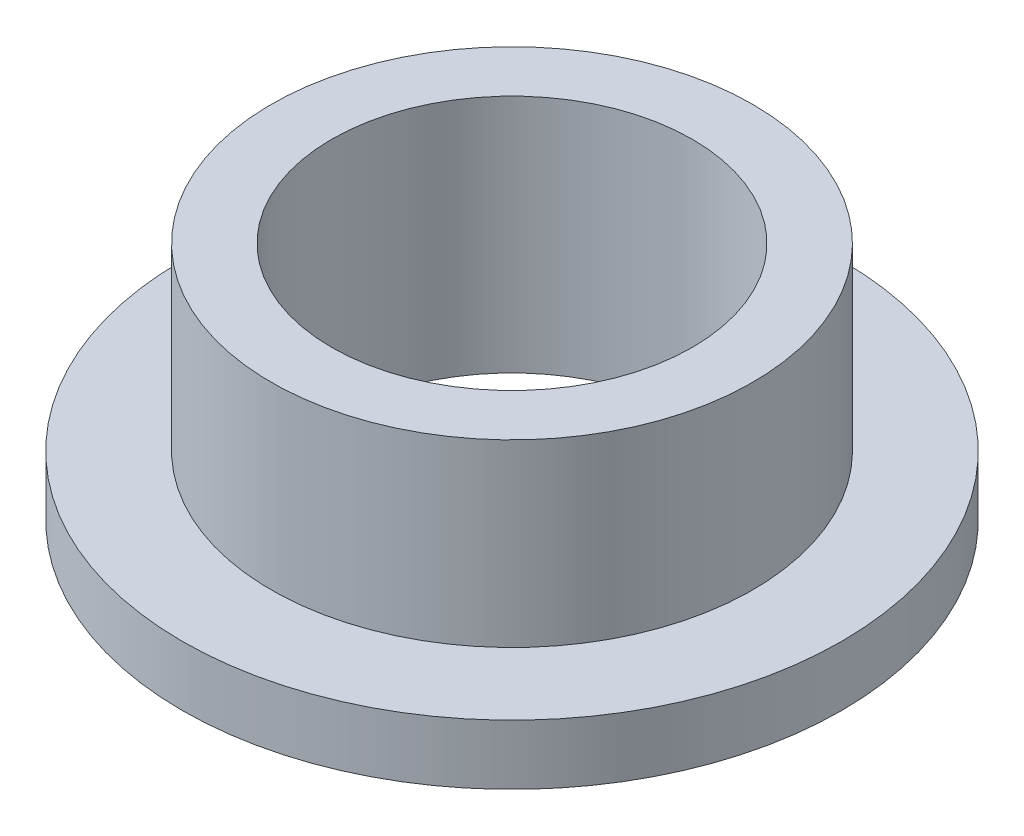
ISO-10303-21;
HEADER;
FILE_DESCRIPTION(('STEP AP214'),'2;1');
FILE_NAME('part.step','',(''),(''),'','','');
FILE_SCHEMA(('AUTOMOTIVE_DESIGN { 1 0 10303 214 1 1 1 1 }'));
ENDSEC;
DATA;
#1=APPLICATION_CONTEXT('core data for automotive mechanical design processes');
#2=APPLICATION_PROTOCOL_DEFINITION('international standard','automotive_design',2000,#1);
#3=PRODUCT_CONTEXT('',#1,'mechanical');
#4=PRODUCT('Part','Part','',(#3));
#5=PRODUCT_RELATED_PRODUCT_CATEGORY('part','',(#4));
#6=PRODUCT_DEFINITION_FORMATION('','',#4);
#7=PRODUCT_DEFINITION_CONTEXT('part definition',#1,'design');
#8=PRODUCT_DEFINITION('design','',#6,#7);
#9=PRODUCT_DEFINITION_SHAPE('','',#8);
#10=(LENGTH_UNIT() NAMED_UNIT(*) SI_UNIT(.MILLI.,.METRE.));
#11=(NAMED_UNIT(*) PLANE_ANGLE_UNIT() SI_UNIT($,.RADIAN.));
#12=(NAMED_UNIT(*) SI_UNIT($,.STERADIAN.) SOLID_ANGLE_UNIT());
#13=UNCERTAINTY_MEASURE_WITH_UNIT(LENGTH_MEASURE(1.E-05),#10,'distance_accuracy_value','');
#14=(GEOMETRIC_REPRESENTATION_CONTEXT(3) GLOBAL_UNCERTAINTY_ASSIGNED_CONTEXT((#13)) GLOBAL_UNIT_ASSIGNED_CONTEXT((#10,
#11,#12)) REPRESENTATION_CONTEXT('',''));
#15=CARTESIAN_POINT('',(0.,0.,0.));
#16=DIRECTION('',(0.,0.,1.));
#17=DIRECTION('',(1.,0.,0.));
#18=AXIS2_PLACEMENT_3D('',#15,#16,#17);
#19=CARTESIAN_POINT('',(0.,6.35,0.));
#20=DIRECTION('',(0.,-1.,0.));
#21=DIRECTION('',(0.,0.,-1.));
#22=AXIS2_PLACEMENT_3D('',#19,#20,#21);
#23=CYLINDRICAL_SURFACE('',#22,6.3754);
#24=CARTESIAN_POINT('',(0.,1.5875,0.));
#25=DIRECTION('',(0.,-1.,0.));
#26=DIRECTION('',(0.,0.,-1.));
#27=AXIS2_PLACEMENT_3D('',#24,#25,#26);
#28=CIRCLE('',#27,6.3754);
#29=CARTESIAN_POINT('',(0.,1.5875,-6.3754));
#30=VERTEX_POINT('',#29);
#31=EDGE_CURVE('E34',#30,#30,#28,.T.);
#32=ORIENTED_EDGE('',*,*,#31,.F.);
#33=EDGE_LOOP('',(#32));
#34=FACE_BOUND('',#33,.T.);
#35=CARTESIAN_POINT('',(0.,6.35,0.));
#36=DIRECTION('',(0.,-1.,0.));
#37=DIRECTION('',(0.,0.,-1.));
#38=AXIS2_PLACEMENT_3D('',#35,#36,#37);
#39=CIRCLE('',#38,6.3754);
#40=CARTESIAN_POINT('',(0.,6.35,-6.3754));
#41=VERTEX_POINT('',#40);
#42=EDGE_CURVE('E18',#41,#41,#39,.F.);
#43=ORIENTED_EDGE('',*,*,#42,.F.);
#44=EDGE_LOOP('',(#43));
#45=FACE_BOUND('',#44,.T.);
#46=ADVANCED_FACE('F15',(#34,#45),#23,.T.);
#47=CARTESIAN_POINT('',(0.,6.35,0.));
#48=DIRECTION('',(0.,1.,0.));
#49=DIRECTION('',(0.,0.,1.));
#50=AXIS2_PLACEMENT_3D('',#47,#48,#49);
#51=PLANE('',#50);
#52=CARTESIAN_POINT('',(0.,6.35,0.));
#53=DIRECTION('',(0.,-1.,0.));
#54=DIRECTION('',(0.,0.,-1.));
#55=AXIS2_PLACEMENT_3D('',#52,#53,#54);
#56=CIRCLE('',#55,4.7752);
#57=CARTESIAN_POINT('',(0.,6.35,-4.7752));
#58=VERTEX_POINT('',#57);
#59=EDGE_CURVE('E32',#58,#58,#56,.T.);
#60=ORIENTED_EDGE('',*,*,#59,.T.);
#61=EDGE_LOOP('',(#60));
#62=FACE_BOUND('',#61,.T.);
#63=ORIENTED_EDGE('',*,*,#42,.T.);
#64=EDGE_LOOP('',(#63));
#65=FACE_BOUND('',#64,.T.);
#66=ADVANCED_FACE('F41',(#62,#65),#51,.T.);
#67=CARTESIAN_POINT('',(0.,1.5875,0.));
#68=DIRECTION('',(0.,1.,0.));
#69=DIRECTION('',(0.,0.,1.));
#70=AXIS2_PLACEMENT_3D('',#67,#68,#69);
#71=PLANE('',#70);
#72=ORIENTED_EDGE('',*,*,#31,.T.);
#73=EDGE_LOOP('',(#72));
#74=FACE_BOUND('',#73,.T.);
#75=CARTESIAN_POINT('',(0.,1.5875,0.));
#76=DIRECTION('',(0.,-1.,0.));
#77=DIRECTION('',(0.,0.,-1.));
#78=AXIS2_PLACEMENT_3D('',#75,#76,#77);
#79=CIRCLE('',#78,8.73125);
#80=CARTESIAN_POINT('',(0.,1.5875,-8.73125));
#81=VERTEX_POINT('',#80);
#82=EDGE_CURVE('E27',#81,#81,#79,.T.);
#83=ORIENTED_EDGE('',*,*,#82,.F.);
#84=EDGE_LOOP('',(#83));
#85=FACE_BOUND('',#84,.T.);
#86=ADVANCED_FACE('F49',(#74,#85),#71,.T.);
#87=CARTESIAN_POINT('',(0.,6.35,0.));
#88=DIRECTION('',(0.,-1.,0.));
#89=DIRECTION('',(0.,0.,-1.));
#90=AXIS2_PLACEMENT_3D('',#87,#88,#89);
#91=CYLINDRICAL_SURFACE('',#90,4.7752);
#92=CARTESIAN_POINT('',(0.,0.,0.));
#93=DIRECTION('',(0.,-1.,0.));
#94=DIRECTION('',(0.,0.,-1.));
#95=AXIS2_PLACEMENT_3D('',#92,#93,#94);
#96=CIRCLE('',#95,4.7752);
#97=CARTESIAN_POINT('',(0.,0.,-4.7752));
#98=VERTEX_POINT('',#97);
#99=EDGE_CURVE('E22',#98,#98,#96,.T.);
#100=ORIENTED_EDGE('',*,*,#99,.T.);
#101=EDGE_LOOP('',(#100));
#102=FACE_BOUND('',#101,.T.);
#103=ORIENTED_EDGE('',*,*,#59,.F.);
#104=EDGE_LOOP('',(#103));
#105=FACE_BOUND('',#104,.T.);
#106=ADVANCED_FACE('F59',(#102,#105),#91,.F.);
#107=CARTESIAN_POINT('',(0.,1.5875,0.));
#108=DIRECTION('',(0.,-1.,0.));
#109=DIRECTION('',(0.,0.,-1.));
#110=AXIS2_PLACEMENT_3D('',#107,#108,#109);
#111=CYLINDRICAL_SURFACE('',#110,8.73125);
#112=ORIENTED_EDGE('',*,*,#82,.T.);
#113=EDGE_LOOP('',(#112));
#114=FACE_BOUND('',#113,.T.);
#115=CARTESIAN_POINT('',(0.,0.,0.));
#116=DIRECTION('',(0.,-1.,0.));
#117=DIRECTION('',(0.,0.,-1.));
#118=AXIS2_PLACEMENT_3D('',#115,#116,#117);
#119=CIRCLE('',#118,8.73125);
#120=CARTESIAN_POINT('',(0.,0.,-8.73125));
#121=VERTEX_POINT('',#120);
#122=EDGE_CURVE('E10',#121,#121,#119,.F.);
#123=ORIENTED_EDGE('',*,*,#122,.T.);
#124=EDGE_LOOP('',(#123));
#125=FACE_BOUND('',#124,.T.);
#126=ADVANCED_FACE('F53',(#114,#125),#111,.T.);
#127=CARTESIAN_POINT('',(0.,0.,0.));
#128=DIRECTION('',(0.,1.,0.));
#129=DIRECTION('',(0.,0.,1.));
#130=AXIS2_PLACEMENT_3D('',#127,#128,#129);
#131=PLANE('',#130);
#132=ORIENTED_EDGE('',*,*,#122,.F.);
#133=EDGE_LOOP('',(#132));
#134=FACE_BOUND('',#133,.T.);
#135=ORIENTED_EDGE('',*,*,#99,.F.);
#136=EDGE_LOOP('',(#135));
#137=FACE_BOUND('',#136,.T.);
#138=ADVANCED_FACE('F51',(#134,#137),#131,.F.);
#139=CLOSED_SHELL('',(#46,#66,#86,#106,#126,#138));
#140=MANIFOLD_SOLID_BREP('B1',#139);
#141=ADVANCED_BREP_SHAPE_REPRESENTATION('',(#18,#140),#14);
#142=SHAPE_DEFINITION_REPRESENTATION(#9,#141);
ENDSEC;
END-ISO-10303-21;
